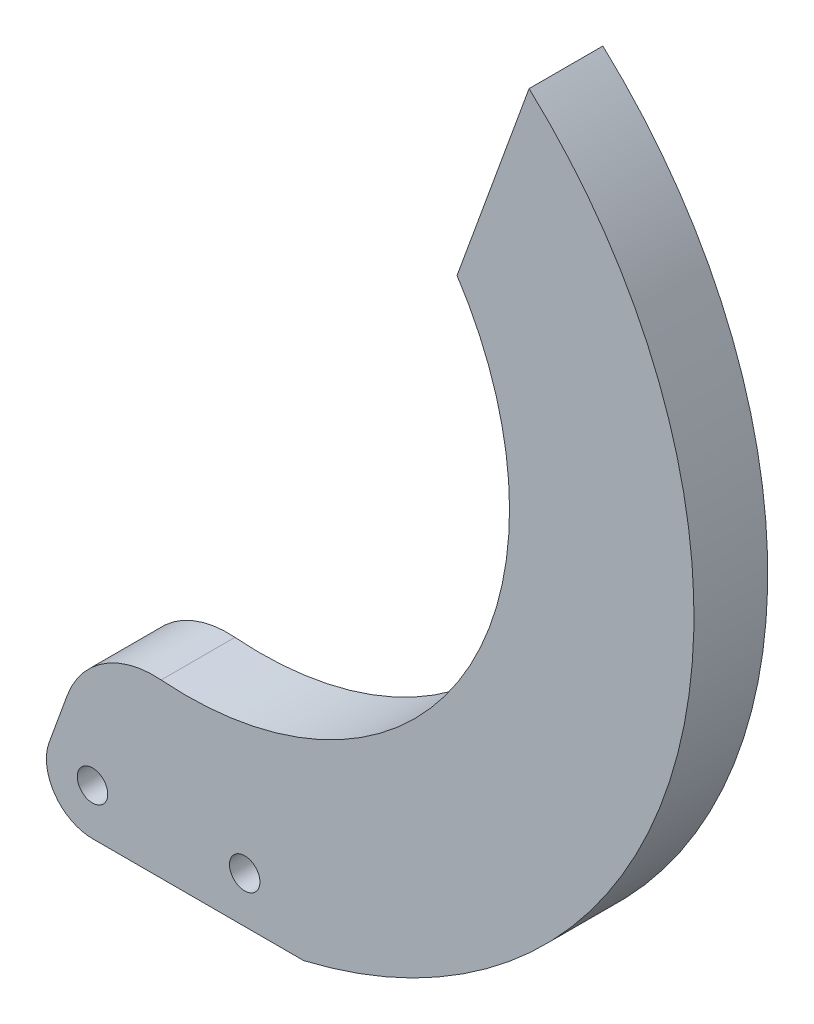
ISO-10303-21;
HEADER;
FILE_DESCRIPTION(('STEP AP214'),'2;1');
FILE_NAME('part.step','',(''),(''),'','','');
FILE_SCHEMA(('AUTOMOTIVE_DESIGN { 1 0 10303 214 1 1 1 1 }'));
ENDSEC;
DATA;
#1=APPLICATION_CONTEXT('core data for automotive mechanical design processes');
#2=APPLICATION_PROTOCOL_DEFINITION('international standard','automotive_design',2000,#1);
#3=PRODUCT_CONTEXT('',#1,'mechanical');
#4=PRODUCT('Part','Part','',(#3));
#5=PRODUCT_RELATED_PRODUCT_CATEGORY('part','',(#4));
#6=PRODUCT_DEFINITION_FORMATION('','',#4);
#7=PRODUCT_DEFINITION_CONTEXT('part definition',#1,'design');
#8=PRODUCT_DEFINITION('design','',#6,#7);
#9=PRODUCT_DEFINITION_SHAPE('','',#8);
#10=(LENGTH_UNIT() NAMED_UNIT(*) SI_UNIT(.MILLI.,.METRE.));
#11=(NAMED_UNIT(*) PLANE_ANGLE_UNIT() SI_UNIT($,.RADIAN.));
#12=(NAMED_UNIT(*) SI_UNIT($,.STERADIAN.) SOLID_ANGLE_UNIT());
#13=UNCERTAINTY_MEASURE_WITH_UNIT(LENGTH_MEASURE(1.E-05),#10,'distance_accuracy_value','');
#14=(GEOMETRIC_REPRESENTATION_CONTEXT(3) GLOBAL_UNCERTAINTY_ASSIGNED_CONTEXT((#13)) GLOBAL_UNIT_ASSIGNED_CONTEXT((#10,
#11,#12)) REPRESENTATION_CONTEXT('',''));
#15=CARTESIAN_POINT('',(0.,0.,0.));
#16=DIRECTION('',(0.,0.,1.));
#17=DIRECTION('',(1.,0.,0.));
#18=AXIS2_PLACEMENT_3D('',#15,#16,#17);
#19=CARTESIAN_POINT('',(0.,0.,8.));
#20=DIRECTION('',(0.,0.,-1.));
#21=DIRECTION('',(-1.,0.,0.));
#22=AXIS2_PLACEMENT_3D('',#19,#20,#21);
#23=CYLINDRICAL_SURFACE('',#22,1.65);
#24=CARTESIAN_POINT('',(0.,0.,8.));
#25=DIRECTION('',(0.,0.,1.));
#26=DIRECTION('',(1.,0.,0.));
#27=AXIS2_PLACEMENT_3D('',#24,#25,#26);
#28=CIRCLE('',#27,1.65);
#29=CARTESIAN_POINT('',(1.65,0.,8.));
#30=VERTEX_POINT('',#29);
#31=EDGE_CURVE('E144',#30,#30,#28,.T.);
#32=ORIENTED_EDGE('',*,*,#31,.T.);
#33=EDGE_LOOP('',(#32));
#34=FACE_BOUND('',#33,.T.);
#35=CARTESIAN_POINT('',(0.,0.,3.));
#36=DIRECTION('',(0.,0.,-1.));
#37=DIRECTION('',(-1.,0.,0.));
#38=AXIS2_PLACEMENT_3D('',#35,#36,#37);
#39=CIRCLE('',#38,1.65);
#40=CARTESIAN_POINT('',(-1.65,0.,3.));
#41=VERTEX_POINT('',#40);
#42=EDGE_CURVE('E36',#41,#41,#39,.T.);
#43=ORIENTED_EDGE('',*,*,#42,.T.);
#44=EDGE_LOOP('',(#43));
#45=FACE_BOUND('',#44,.T.);
#46=ADVANCED_FACE('F32',(#34,#45),#23,.F.);
#47=CARTESIAN_POINT('',(0.,0.,8.));
#48=DIRECTION('',(0.,0.,1.));
#49=DIRECTION('',(1.,0.,0.));
#50=AXIS2_PLACEMENT_3D('',#47,#48,#49);
#51=PLANE('',#50);
#52=ORIENTED_EDGE('',*,*,#31,.F.);
#53=EDGE_LOOP('',(#52));
#54=FACE_BOUND('',#53,.T.);
#55=CARTESIAN_POINT('',(10.2151518274149,48.5181205647917,8.));
#56=DIRECTION('',(0.,0.,-1.));
#57=DIRECTION('',(1.,0.,0.));
#58=AXIS2_PLACEMENT_3D('',#55,#56,#57);
#59=CIRCLE('',#58,35.);
#60=CARTESIAN_POINT('',(39.5252608770376,67.6470909369582,8.));
#61=VERTEX_POINT('',#60);
#62=CARTESIAN_POINT('',(7.44442006285707,13.627963708038,8.));
#63=VERTEX_POINT('',#62);
#64=EDGE_CURVE('E146',#61,#63,#59,.T.);
#65=ORIENTED_EDGE('',*,*,#64,.T.);
#66=CARTESIAN_POINT('',(6.65278241584056,3.65934746325131,8.));
#67=DIRECTION('',(0.,0.,1.));
#68=DIRECTION('',(1.,0.,0.));
#69=AXIS2_PLACEMENT_3D('',#66,#67,#68);
#70=CIRCLE('',#69,10.);
#71=CARTESIAN_POINT('',(-2.74414379201854,7.07954889650796,8.));
#72=VERTEX_POINT('',#71);
#73=EDGE_CURVE('E11',#63,#72,#70,.T.);
#74=ORIENTED_EDGE('',*,*,#73,.T.);
#75=DIRECTION('',(-0.342020143325666,-0.939692620785909,0.));
#76=VECTOR('',#75,1.);
#77=CARTESIAN_POINT('',(-4.69846310392955,1.71010071662833,8.));
#78=LINE('',#77,#76);
#79=CARTESIAN_POINT('',(-4.69846310392955,1.71010071662833,8.));
#80=VERTEX_POINT('',#79);
#81=EDGE_CURVE('E109',#72,#80,#78,.T.);
#82=ORIENTED_EDGE('',*,*,#81,.T.);
#83=CARTESIAN_POINT('',(0.,0.,8.));
#84=DIRECTION('',(0.,0.,1.));
#85=DIRECTION('',(1.,0.,0.));
#86=AXIS2_PLACEMENT_3D('',#83,#84,#85);
#87=CIRCLE('',#86,5.);
#88=CARTESIAN_POINT('',(0.,-5.,8.));
#89=VERTEX_POINT('',#88);
#90=EDGE_CURVE('E103',#80,#89,#87,.T.);
#91=ORIENTED_EDGE('',*,*,#90,.T.);
#92=DIRECTION('',(1.,0.,0.));
#93=VECTOR('',#92,1.);
#94=CARTESIAN_POINT('',(0.,-5.,8.));
#95=LINE('',#94,#93);
#96=CARTESIAN_POINT('',(22.8962705167271,-5.,8.));
#97=VERTEX_POINT('',#96);
#98=EDGE_CURVE('E92',#89,#97,#95,.T.);
#99=ORIENTED_EDGE('',*,*,#98,.T.);
#100=CARTESIAN_POINT('',(10.2151518274149,48.5181205647917,8.));
#101=DIRECTION('',(0.,0.,1.));
#102=DIRECTION('',(1.,0.,0.));
#103=AXIS2_PLACEMENT_3D('',#100,#101,#102);
#104=CIRCLE('',#103,55.);
#105=CARTESIAN_POINT('',(47.3346273679292,89.1031490309287,8.));
#106=VERTEX_POINT('',#105);
#107=EDGE_CURVE('E102',#97,#106,#104,.T.);
#108=ORIENTED_EDGE('',*,*,#107,.T.);
#109=DIRECTION('',(-0.342020143325666,-0.939692620785909,0.));
#110=VECTOR('',#109,1.);
#111=CARTESIAN_POINT('',(47.3346273679292,89.1031490309287,8.));
#112=LINE('',#111,#110);
#113=EDGE_CURVE('E148',#106,#61,#112,.T.);
#114=ORIENTED_EDGE('',*,*,#113,.T.);
#115=EDGE_LOOP('',(#65,#74,#82,#91,#99,#108,#114));
#116=FACE_BOUND('',#115,.T.);
#117=CARTESIAN_POINT('',(16.5,0.,8.));
#118=DIRECTION('',(0.,0.,1.));
#119=DIRECTION('',(1.,0.,0.));
#120=AXIS2_PLACEMENT_3D('',#117,#118,#119);
#121=CIRCLE('',#120,1.65);
#122=CARTESIAN_POINT('',(18.15,0.,8.));
#123=VERTEX_POINT('',#122);
#124=EDGE_CURVE('E153',#123,#123,#121,.T.);
#125=ORIENTED_EDGE('',*,*,#124,.F.);
#126=EDGE_LOOP('',(#125));
#127=FACE_BOUND('',#126,.T.);
#128=ADVANCED_FACE('F106',(#54,#116,#127),#51,.T.);
#129=CARTESIAN_POINT('',(0.,0.,0.));
#130=DIRECTION('',(0.,0.,1.));
#131=DIRECTION('',(1.,0.,0.));
#132=AXIS2_PLACEMENT_3D('',#129,#130,#131);
#133=PLANE('',#132);
#134=CARTESIAN_POINT('',(0.,0.,0.));
#135=DIRECTION('',(0.,0.,-1.));
#136=DIRECTION('',(-1.,0.,0.));
#137=AXIS2_PLACEMENT_3D('',#134,#135,#136);
#138=CIRCLE('',#137,4.);
#139=CARTESIAN_POINT('',(-4.,0.,0.));
#140=VERTEX_POINT('',#139);
#141=EDGE_CURVE('E159',#140,#140,#138,.T.);
#142=ORIENTED_EDGE('',*,*,#141,.F.);
#143=EDGE_LOOP('',(#142));
#144=FACE_BOUND('',#143,.T.);
#145=DIRECTION('',(-0.342020143325666,-0.939692620785909,0.));
#146=VECTOR('',#145,1.);
#147=CARTESIAN_POINT('',(-4.69846310392955,1.71010071662833,0.));
#148=LINE('',#147,#146);
#149=CARTESIAN_POINT('',(-2.74414379201854,7.07954889650796,0.));
#150=VERTEX_POINT('',#149);
#151=CARTESIAN_POINT('',(-4.69846310392955,1.71010071662833,0.));
#152=VERTEX_POINT('',#151);
#153=EDGE_CURVE('E113',#150,#152,#148,.T.);
#154=ORIENTED_EDGE('',*,*,#153,.F.);
#155=CARTESIAN_POINT('',(6.65278241584056,3.65934746325131,0.));
#156=DIRECTION('',(0.,0.,1.));
#157=DIRECTION('',(1.,0.,0.));
#158=AXIS2_PLACEMENT_3D('',#155,#156,#157);
#159=CIRCLE('',#158,10.);
#160=CARTESIAN_POINT('',(7.44442006285707,13.627963708038,0.));
#161=VERTEX_POINT('',#160);
#162=EDGE_CURVE('E55',#150,#161,#159,.F.);
#163=ORIENTED_EDGE('',*,*,#162,.T.);
#164=CARTESIAN_POINT('',(10.2151518274149,48.5181205647917,0.));
#165=DIRECTION('',(0.,0.,-1.));
#166=DIRECTION('',(1.,0.,0.));
#167=AXIS2_PLACEMENT_3D('',#164,#165,#166);
#168=CIRCLE('',#167,35.);
#169=CARTESIAN_POINT('',(39.5252608770376,67.6470909369582,0.));
#170=VERTEX_POINT('',#169);
#171=EDGE_CURVE('E135',#170,#161,#168,.T.);
#172=ORIENTED_EDGE('',*,*,#171,.F.);
#173=DIRECTION('',(-0.342020143325666,-0.939692620785909,0.));
#174=VECTOR('',#173,1.);
#175=CARTESIAN_POINT('',(47.3346273679292,89.1031490309287,0.));
#176=LINE('',#175,#174);
#177=CARTESIAN_POINT('',(47.3346273679292,89.1031490309287,0.));
#178=VERTEX_POINT('',#177);
#179=EDGE_CURVE('E137',#178,#170,#176,.T.);
#180=ORIENTED_EDGE('',*,*,#179,.F.);
#181=CARTESIAN_POINT('',(10.2151518274149,48.5181205647917,0.));
#182=DIRECTION('',(0.,0.,1.));
#183=DIRECTION('',(1.,0.,0.));
#184=AXIS2_PLACEMENT_3D('',#181,#182,#183);
#185=CIRCLE('',#184,55.);
#186=CARTESIAN_POINT('',(22.8962705167271,-5.,0.));
#187=VERTEX_POINT('',#186);
#188=EDGE_CURVE('E139',#187,#178,#185,.T.);
#189=ORIENTED_EDGE('',*,*,#188,.F.);
#190=DIRECTION('',(1.,0.,0.));
#191=VECTOR('',#190,1.);
#192=CARTESIAN_POINT('',(0.,-5.,0.));
#193=LINE('',#192,#191);
#194=CARTESIAN_POINT('',(0.,-5.,0.));
#195=VERTEX_POINT('',#194);
#196=EDGE_CURVE('E141',#195,#187,#193,.T.);
#197=ORIENTED_EDGE('',*,*,#196,.F.);
#198=CARTESIAN_POINT('',(0.,0.,0.));
#199=DIRECTION('',(0.,0.,1.));
#200=DIRECTION('',(1.,0.,0.));
#201=AXIS2_PLACEMENT_3D('',#198,#199,#200);
#202=CIRCLE('',#201,5.);
#203=EDGE_CURVE('E117',#152,#195,#202,.T.);
#204=ORIENTED_EDGE('',*,*,#203,.F.);
#205=EDGE_LOOP('',(#154,#163,#172,#180,#189,#197,#204));
#206=FACE_BOUND('',#205,.T.);
#207=CARTESIAN_POINT('',(16.5,0.,0.));
#208=DIRECTION('',(0.,0.,1.));
#209=DIRECTION('',(1.,0.,0.));
#210=AXIS2_PLACEMENT_3D('',#207,#208,#209);
#211=CIRCLE('',#210,1.65);
#212=CARTESIAN_POINT('',(18.15,0.,0.));
#213=VERTEX_POINT('',#212);
#214=EDGE_CURVE('E154',#213,#213,#211,.T.);
#215=ORIENTED_EDGE('',*,*,#214,.T.);
#216=EDGE_LOOP('',(#215));
#217=FACE_BOUND('',#216,.T.);
#218=ADVANCED_FACE('F185',(#144,#206,#217),#133,.F.);
#219=CARTESIAN_POINT('',(0.,0.,8.));
#220=DIRECTION('',(0.,0.,-1.));
#221=DIRECTION('',(-1.,0.,0.));
#222=AXIS2_PLACEMENT_3D('',#219,#220,#221);
#223=CYLINDRICAL_SURFACE('',#222,5.);
#224=ORIENTED_EDGE('',*,*,#203,.T.);
#225=DIRECTION('',(0.,0.,-1.));
#226=VECTOR('',#225,1.);
#227=CARTESIAN_POINT('',(0.,-5.,8.));
#228=LINE('',#227,#226);
#229=EDGE_CURVE('E96',#89,#195,#228,.T.);
#230=ORIENTED_EDGE('',*,*,#229,.F.);
#231=ORIENTED_EDGE('',*,*,#90,.F.);
#232=DIRECTION('',(0.,0.,-1.));
#233=VECTOR('',#232,1.);
#234=CARTESIAN_POINT('',(-4.69846310392955,1.71010071662833,8.));
#235=LINE('',#234,#233);
#236=EDGE_CURVE('E132',#80,#152,#235,.T.);
#237=ORIENTED_EDGE('',*,*,#236,.T.);
#238=EDGE_LOOP('',(#224,#230,#231,#237));
#239=FACE_BOUND('',#238,.T.);
#240=ADVANCED_FACE('F115',(#239),#223,.T.);
#241=CARTESIAN_POINT('',(0.,-5.,8.));
#242=DIRECTION('',(0.,1.,0.));
#243=DIRECTION('',(-1.,0.,0.));
#244=AXIS2_PLACEMENT_3D('',#241,#242,#243);
#245=PLANE('',#244);
#246=ORIENTED_EDGE('',*,*,#196,.T.);
#247=DIRECTION('',(0.,0.,-1.));
#248=VECTOR('',#247,1.);
#249=CARTESIAN_POINT('',(22.8962705167271,-5.,8.));
#250=LINE('',#249,#248);
#251=EDGE_CURVE('E99',#97,#187,#250,.T.);
#252=ORIENTED_EDGE('',*,*,#251,.F.);
#253=ORIENTED_EDGE('',*,*,#98,.F.);
#254=ORIENTED_EDGE('',*,*,#229,.T.);
#255=EDGE_LOOP('',(#246,#252,#253,#254));
#256=FACE_BOUND('',#255,.T.);
#257=ADVANCED_FACE('F94',(#256),#245,.F.);
#258=CARTESIAN_POINT('',(10.2151518274149,48.5181205647917,8.));
#259=DIRECTION('',(0.,0.,-1.));
#260=DIRECTION('',(-1.,0.,0.));
#261=AXIS2_PLACEMENT_3D('',#258,#259,#260);
#262=CYLINDRICAL_SURFACE('',#261,55.);
#263=ORIENTED_EDGE('',*,*,#188,.T.);
#264=DIRECTION('',(0.,0.,-1.));
#265=VECTOR('',#264,1.);
#266=CARTESIAN_POINT('',(47.3346273679292,89.1031490309287,8.));
#267=LINE('',#266,#265);
#268=EDGE_CURVE('E122',#106,#178,#267,.T.);
#269=ORIENTED_EDGE('',*,*,#268,.F.);
#270=ORIENTED_EDGE('',*,*,#107,.F.);
#271=ORIENTED_EDGE('',*,*,#251,.T.);
#272=EDGE_LOOP('',(#263,#269,#270,#271));
#273=FACE_BOUND('',#272,.T.);
#274=ADVANCED_FACE('F204',(#273),#262,.T.);
#275=CARTESIAN_POINT('',(47.3346273679292,89.1031490309287,8.));
#276=DIRECTION('',(0.939692620785909,-0.342020143325666,0.));
#277=DIRECTION('',(0.342020143325666,0.939692620785909,0.));
#278=AXIS2_PLACEMENT_3D('',#275,#276,#277);
#279=PLANE('',#278);
#280=ORIENTED_EDGE('',*,*,#179,.T.);
#281=DIRECTION('',(0.,0.,-1.));
#282=VECTOR('',#281,1.);
#283=CARTESIAN_POINT('',(39.5252608770376,67.6470909369582,8.));
#284=LINE('',#283,#282);
#285=EDGE_CURVE('E129',#61,#170,#284,.T.);
#286=ORIENTED_EDGE('',*,*,#285,.F.);
#287=ORIENTED_EDGE('',*,*,#113,.F.);
#288=ORIENTED_EDGE('',*,*,#268,.T.);
#289=EDGE_LOOP('',(#280,#286,#287,#288));
#290=FACE_BOUND('',#289,.T.);
#291=ADVANCED_FACE('F201',(#290),#279,.F.);
#292=CARTESIAN_POINT('',(10.2151518274149,48.5181205647917,8.));
#293=DIRECTION('',(0.,0.,-1.));
#294=DIRECTION('',(-1.,0.,0.));
#295=AXIS2_PLACEMENT_3D('',#292,#293,#294);
#296=CYLINDRICAL_SURFACE('',#295,35.);
#297=ORIENTED_EDGE('',*,*,#171,.T.);
#298=DIRECTION('',(0.,0.,-1.));
#299=VECTOR('',#298,1.);
#300=CARTESIAN_POINT('',(7.44442006285707,13.627963708038,8.));
#301=LINE('',#300,#299);
#302=EDGE_CURVE('E41',#161,#63,#301,.F.);
#303=ORIENTED_EDGE('',*,*,#302,.T.);
#304=ORIENTED_EDGE('',*,*,#64,.F.);
#305=ORIENTED_EDGE('',*,*,#285,.T.);
#306=EDGE_LOOP('',(#297,#303,#304,#305));
#307=FACE_BOUND('',#306,.T.);
#308=ADVANCED_FACE('F197',(#307),#296,.F.);
#309=CARTESIAN_POINT('',(-4.69846310392955,1.71010071662833,8.));
#310=DIRECTION('',(0.93969262078591,-0.342020143325666,0.));
#311=DIRECTION('',(0.342020143325666,0.93969262078591,0.));
#312=AXIS2_PLACEMENT_3D('',#309,#310,#311);
#313=PLANE('',#312);
#314=ORIENTED_EDGE('',*,*,#81,.F.);
#315=DIRECTION('',(0.,0.,-1.));
#316=VECTOR('',#315,1.);
#317=CARTESIAN_POINT('',(-2.74414379201854,7.07954889650796,8.));
#318=LINE('',#317,#316);
#319=EDGE_CURVE('E118',#72,#150,#318,.T.);
#320=ORIENTED_EDGE('',*,*,#319,.T.);
#321=ORIENTED_EDGE('',*,*,#153,.T.);
#322=ORIENTED_EDGE('',*,*,#236,.F.);
#323=EDGE_LOOP('',(#314,#320,#321,#322));
#324=FACE_BOUND('',#323,.T.);
#325=ADVANCED_FACE('F194',(#324),#313,.F.);
#326=CARTESIAN_POINT('',(16.5,0.,8.));
#327=DIRECTION('',(0.,0.,-1.));
#328=DIRECTION('',(-1.,0.,0.));
#329=AXIS2_PLACEMENT_3D('',#326,#327,#328);
#330=CYLINDRICAL_SURFACE('',#329,1.65);
#331=ORIENTED_EDGE('',*,*,#124,.T.);
#332=EDGE_LOOP('',(#331));
#333=FACE_BOUND('',#332,.T.);
#334=ORIENTED_EDGE('',*,*,#214,.F.);
#335=EDGE_LOOP('',(#334));
#336=FACE_BOUND('',#335,.T.);
#337=ADVANCED_FACE('F189',(#333,#336),#330,.F.);
#338=CARTESIAN_POINT('',(6.65278241584056,3.65934746325131,8.));
#339=DIRECTION('',(0.,0.,-1.));
#340=DIRECTION('',(-1.,0.,0.));
#341=AXIS2_PLACEMENT_3D('',#338,#339,#340);
#342=CYLINDRICAL_SURFACE('',#341,10.);
#343=ORIENTED_EDGE('',*,*,#73,.F.);
#344=ORIENTED_EDGE('',*,*,#302,.F.);
#345=ORIENTED_EDGE('',*,*,#162,.F.);
#346=ORIENTED_EDGE('',*,*,#319,.F.);
#347=EDGE_LOOP('',(#343,#344,#345,#346));
#348=FACE_BOUND('',#347,.T.);
#349=ADVANCED_FACE('F34',(#348),#342,.T.);
#350=CARTESIAN_POINT('',(0.,0.,3.));
#351=DIRECTION('',(0.,0.,-1.));
#352=DIRECTION('',(-1.,0.,0.));
#353=AXIS2_PLACEMENT_3D('',#350,#351,#352);
#354=CYLINDRICAL_SURFACE('',#353,4.);
#355=CARTESIAN_POINT('',(0.,0.,3.));
#356=DIRECTION('',(0.,0.,-1.));
#357=DIRECTION('',(-1.,0.,0.));
#358=AXIS2_PLACEMENT_3D('',#355,#356,#357);
#359=CIRCLE('',#358,4.);
#360=CARTESIAN_POINT('',(-4.,0.,3.));
#361=VERTEX_POINT('',#360);
#362=EDGE_CURVE('E162',#361,#361,#359,.T.);
#363=ORIENTED_EDGE('',*,*,#362,.F.);
#364=EDGE_LOOP('',(#363));
#365=FACE_BOUND('',#364,.T.);
#366=ORIENTED_EDGE('',*,*,#141,.T.);
#367=EDGE_LOOP('',(#366));
#368=FACE_BOUND('',#367,.T.);
#369=ADVANCED_FACE('F172',(#365,#368),#354,.F.);
#370=CARTESIAN_POINT('',(0.,0.,3.));
#371=DIRECTION('',(0.,0.,-1.));
#372=DIRECTION('',(-1.,0.,0.));
#373=AXIS2_PLACEMENT_3D('',#370,#371,#372);
#374=PLANE('',#373);
#375=ORIENTED_EDGE('',*,*,#42,.F.);
#376=EDGE_LOOP('',(#375));
#377=FACE_BOUND('',#376,.T.);
#378=ORIENTED_EDGE('',*,*,#362,.T.);
#379=EDGE_LOOP('',(#378));
#380=FACE_BOUND('',#379,.T.);
#381=ADVANCED_FACE('F170',(#377,#380),#374,.T.);
#382=CLOSED_SHELL('',(#46,#128,#218,#240,#257,#274,#291,#308,#325,#337,#349,#369,#381));
#383=MANIFOLD_SOLID_BREP('B2',#382);
#384=ADVANCED_BREP_SHAPE_REPRESENTATION('',(#18,#383),#14);
#385=SHAPE_DEFINITION_REPRESENTATION(#9,#384);
ENDSEC;
END-ISO-10303-21;
